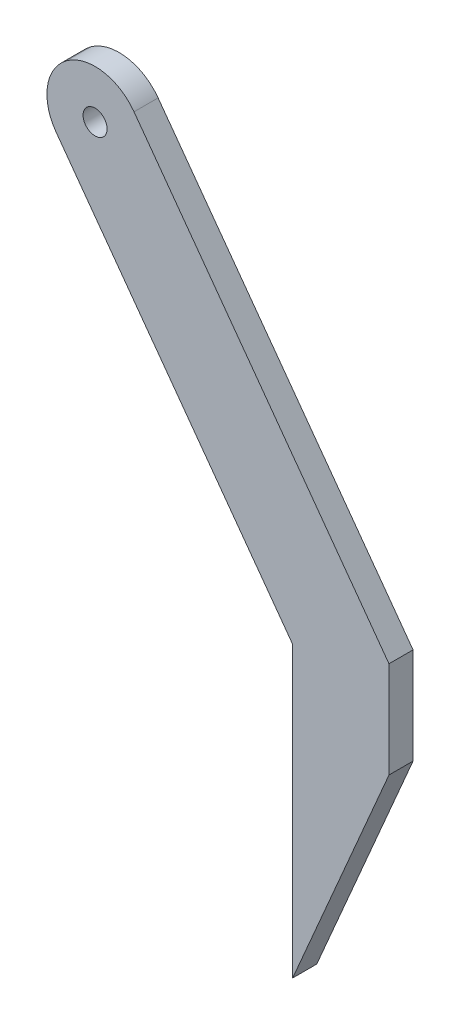
ISO-10303-21;
HEADER;
FILE_DESCRIPTION(('STEP AP214'),'2;1');
FILE_NAME('part.step','',(''),(''),'','','');
FILE_SCHEMA(('AUTOMOTIVE_DESIGN { 1 0 10303 214 1 1 1 1 }'));
ENDSEC;
DATA;
#1=APPLICATION_CONTEXT('core data for automotive mechanical design processes');
#2=APPLICATION_PROTOCOL_DEFINITION('international standard','automotive_design',2000,#1);
#3=PRODUCT_CONTEXT('',#1,'mechanical');
#4=PRODUCT('Part','Part','',(#3));
#5=PRODUCT_RELATED_PRODUCT_CATEGORY('part','',(#4));
#6=PRODUCT_DEFINITION_FORMATION('','',#4);
#7=PRODUCT_DEFINITION_CONTEXT('part definition',#1,'design');
#8=PRODUCT_DEFINITION('design','',#6,#7);
#9=PRODUCT_DEFINITION_SHAPE('','',#8);
#10=(LENGTH_UNIT() NAMED_UNIT(*) SI_UNIT(.MILLI.,.METRE.));
#11=(NAMED_UNIT(*) PLANE_ANGLE_UNIT() SI_UNIT($,.RADIAN.));
#12=(NAMED_UNIT(*) SI_UNIT($,.STERADIAN.) SOLID_ANGLE_UNIT());
#13=UNCERTAINTY_MEASURE_WITH_UNIT(LENGTH_MEASURE(1.E-05),#10,'distance_accuracy_value','');
#14=(GEOMETRIC_REPRESENTATION_CONTEXT(3) GLOBAL_UNCERTAINTY_ASSIGNED_CONTEXT((#13)) GLOBAL_UNIT_ASSIGNED_CONTEXT((#10,
#11,#12)) REPRESENTATION_CONTEXT('',''));
#15=CARTESIAN_POINT('',(0.,0.,0.));
#16=DIRECTION('',(0.,0.,1.));
#17=DIRECTION('',(1.,0.,0.));
#18=AXIS2_PLACEMENT_3D('',#15,#16,#17);
#19=CARTESIAN_POINT('',(26.3484260996102,-41.8429906454596,12.7));
#20=DIRECTION('',(0.808736084303188,0.588171697675046,0.));
#21=DIRECTION('',(-0.588171697675047,0.808736084303189,0.));
#22=AXIS2_PLACEMENT_3D('',#19,#20,#21);
#23=PLANE('',#22);
#24=DIRECTION('',(0.588171697675046,-0.808736084303188,0.));
#25=VECTOR('',#24,1.);
#26=CARTESIAN_POINT('',(26.3484260996102,-41.8429906454596,12.7));
#27=LINE('',#26,#25);
#28=CARTESIAN_POINT('',(-98.3914170715074,129.674293714827,12.7));
#29=VERTEX_POINT('',#28);
#30=CARTESIAN_POINT('',(26.3484260996102,-41.8429906454596,12.7));
#31=VERTEX_POINT('',#30);
#32=EDGE_CURVE('E88',#29,#31,#27,.T.);
#33=ORIENTED_EDGE('',*,*,#32,.F.);
#34=DIRECTION('',(0.,0.,-1.));
#35=VECTOR('',#34,1.);
#36=CARTESIAN_POINT('',(-98.3914170715074,129.674293714827,12.7));
#37=LINE('',#36,#35);
#38=CARTESIAN_POINT('',(-98.3914170715074,129.674293714827,0.));
#39=VERTEX_POINT('',#38);
#40=EDGE_CURVE('E112',#29,#39,#37,.T.);
#41=ORIENTED_EDGE('',*,*,#40,.T.);
#42=DIRECTION('',(0.588171697675046,-0.808736084303188,0.));
#43=VECTOR('',#42,1.);
#44=CARTESIAN_POINT('',(26.3484260996102,-41.8429906454596,0.));
#45=LINE('',#44,#43);
#46=CARTESIAN_POINT('',(26.3484260996102,-41.8429906454596,0.));
#47=VERTEX_POINT('',#46);
#48=EDGE_CURVE('E110',#39,#47,#45,.T.);
#49=ORIENTED_EDGE('',*,*,#48,.T.);
#50=DIRECTION('',(0.,0.,-1.));
#51=VECTOR('',#50,1.);
#52=CARTESIAN_POINT('',(26.3484260996102,-41.8429906454596,12.7));
#53=LINE('',#52,#51);
#54=EDGE_CURVE('E103',#31,#47,#53,.T.);
#55=ORIENTED_EDGE('',*,*,#54,.F.);
#56=EDGE_LOOP('',(#33,#41,#49,#55));
#57=FACE_BOUND('',#56,.T.);
#58=ADVANCED_FACE('F30',(#57),#23,.F.);
#59=CARTESIAN_POINT('',(26.3484260996102,-194.24299064546,12.7));
#60=DIRECTION('',(1.,0.,0.));
#61=DIRECTION('',(0.,1.,0.));
#62=AXIS2_PLACEMENT_3D('',#59,#60,#61);
#63=PLANE('',#62);
#64=DIRECTION('',(0.,-1.,0.));
#65=VECTOR('',#64,1.);
#66=CARTESIAN_POINT('',(26.3484260996102,-194.24299064546,0.));
#67=LINE('',#66,#65);
#68=CARTESIAN_POINT('',(26.3484260996102,-194.24299064546,0.));
#69=VERTEX_POINT('',#68);
#70=EDGE_CURVE('E133',#47,#69,#67,.T.);
#71=ORIENTED_EDGE('',*,*,#70,.T.);
#72=DIRECTION('',(0.,0.,-1.));
#73=VECTOR('',#72,1.);
#74=CARTESIAN_POINT('',(26.3484260996102,-194.24299064546,12.7));
#75=LINE('',#74,#73);
#76=CARTESIAN_POINT('',(26.3484260996102,-194.24299064546,12.7));
#77=VERTEX_POINT('',#76);
#78=EDGE_CURVE('E105',#77,#69,#75,.T.);
#79=ORIENTED_EDGE('',*,*,#78,.F.);
#80=DIRECTION('',(0.,-1.,0.));
#81=VECTOR('',#80,1.);
#82=CARTESIAN_POINT('',(26.3484260996102,-194.24299064546,12.7));
#83=LINE('',#82,#81);
#84=EDGE_CURVE('E91',#31,#77,#83,.T.);
#85=ORIENTED_EDGE('',*,*,#84,.F.);
#86=ORIENTED_EDGE('',*,*,#54,.T.);
#87=EDGE_LOOP('',(#71,#79,#85,#86));
#88=FACE_BOUND('',#87,.T.);
#89=ADVANCED_FACE('F102',(#88),#63,.F.);
#90=CARTESIAN_POINT('',(77.1484260996102,-76.1236529149896,12.7));
#91=DIRECTION('',(-0.91864467419625,0.395084753655296,0.));
#92=DIRECTION('',(-0.395084753655296,-0.91864467419625,0.));
#93=AXIS2_PLACEMENT_3D('',#90,#91,#92);
#94=PLANE('',#93);
#95=DIRECTION('',(0.395084753655296,0.91864467419625,0.));
#96=VECTOR('',#95,1.);
#97=CARTESIAN_POINT('',(77.1484260996102,-76.1236529149896,0.));
#98=LINE('',#97,#96);
#99=CARTESIAN_POINT('',(77.1484260996102,-76.1236529149896,0.));
#100=VERTEX_POINT('',#99);
#101=EDGE_CURVE('E150',#69,#100,#98,.T.);
#102=ORIENTED_EDGE('',*,*,#101,.T.);
#103=DIRECTION('',(0.,0.,-1.));
#104=VECTOR('',#103,1.);
#105=CARTESIAN_POINT('',(77.1484260996102,-76.1236529149896,12.7));
#106=LINE('',#105,#104);
#107=CARTESIAN_POINT('',(77.1484260996102,-76.1236529149896,12.7));
#108=VERTEX_POINT('',#107);
#109=EDGE_CURVE('E116',#108,#100,#106,.T.);
#110=ORIENTED_EDGE('',*,*,#109,.F.);
#111=DIRECTION('',(0.395084753655296,0.91864467419625,0.));
#112=VECTOR('',#111,1.);
#113=CARTESIAN_POINT('',(77.1484260996102,-76.1236529149896,12.7));
#114=LINE('',#113,#112);
#115=EDGE_CURVE('E107',#77,#108,#114,.T.);
#116=ORIENTED_EDGE('',*,*,#115,.F.);
#117=ORIENTED_EDGE('',*,*,#78,.T.);
#118=EDGE_LOOP('',(#102,#110,#116,#117));
#119=FACE_BOUND('',#118,.T.);
#120=ADVANCED_FACE('F166',(#119),#94,.F.);
#121=CARTESIAN_POINT('',(77.1484260996102,-25.3236529149896,12.7));
#122=DIRECTION('',(-1.,0.,0.));
#123=DIRECTION('',(0.,-1.,0.));
#124=AXIS2_PLACEMENT_3D('',#121,#122,#123);
#125=PLANE('',#124);
#126=DIRECTION('',(0.,1.,0.));
#127=VECTOR('',#126,1.);
#128=CARTESIAN_POINT('',(77.1484260996102,-25.3236529149896,0.));
#129=LINE('',#128,#127);
#130=CARTESIAN_POINT('',(77.1484260996102,-25.3236529149896,0.));
#131=VERTEX_POINT('',#130);
#132=EDGE_CURVE('E152',#100,#131,#129,.T.);
#133=ORIENTED_EDGE('',*,*,#132,.T.);
#134=DIRECTION('',(0.,0.,-1.));
#135=VECTOR('',#134,1.);
#136=CARTESIAN_POINT('',(77.1484260996102,-25.3236529149896,12.7));
#137=LINE('',#136,#135);
#138=CARTESIAN_POINT('',(77.1484260996102,-25.3236529149896,12.7));
#139=VERTEX_POINT('',#138);
#140=EDGE_CURVE('E147',#139,#131,#137,.T.);
#141=ORIENTED_EDGE('',*,*,#140,.F.);
#142=DIRECTION('',(0.,1.,0.));
#143=VECTOR('',#142,1.);
#144=CARTESIAN_POINT('',(77.1484260996102,-25.3236529149896,12.7));
#145=LINE('',#144,#143);
#146=EDGE_CURVE('E144',#108,#139,#145,.T.);
#147=ORIENTED_EDGE('',*,*,#146,.F.);
#148=ORIENTED_EDGE('',*,*,#109,.T.);
#149=EDGE_LOOP('',(#133,#141,#147,#148));
#150=FACE_BOUND('',#149,.T.);
#151=ADVANCED_FACE('F161',(#150),#125,.F.);
#152=CARTESIAN_POINT('',(-72.2471851098516,180.09531249802,12.7));
#153=DIRECTION('',(-0.808736084303188,-0.588171697675047,0.));
#154=DIRECTION('',(0.588171697675047,-0.808736084303188,0.));
#155=AXIS2_PLACEMENT_3D('',#152,#153,#154);
#156=PLANE('',#155);
#157=DIRECTION('',(-0.588171697675046,0.808736084303188,0.));
#158=VECTOR('',#157,1.);
#159=CARTESIAN_POINT('',(-72.2471851098516,180.09531249802,0.));
#160=LINE('',#159,#158);
#161=CARTESIAN_POINT('',(-57.3076239889054,159.553415956719,0.));
#162=VERTEX_POINT('',#161);
#163=EDGE_CURVE('E98',#131,#162,#160,.T.);
#164=ORIENTED_EDGE('',*,*,#163,.T.);
#165=DIRECTION('',(0.,0.,-1.));
#166=VECTOR('',#165,1.);
#167=CARTESIAN_POINT('',(-57.3076239889054,159.553415956719,12.7));
#168=LINE('',#167,#166);
#169=CARTESIAN_POINT('',(-57.3076239889054,159.553415956719,12.7));
#170=VERTEX_POINT('',#169);
#171=EDGE_CURVE('E11',#162,#170,#168,.F.);
#172=ORIENTED_EDGE('',*,*,#171,.T.);
#173=DIRECTION('',(-0.588171697675046,0.808736084303188,0.));
#174=VECTOR('',#173,1.);
#175=CARTESIAN_POINT('',(-72.2471851098516,180.09531249802,12.7));
#176=LINE('',#175,#174);
#177=EDGE_CURVE('E146',#139,#170,#176,.T.);
#178=ORIENTED_EDGE('',*,*,#177,.F.);
#179=ORIENTED_EDGE('',*,*,#140,.T.);
#180=EDGE_LOOP('',(#164,#172,#178,#179));
#181=FACE_BOUND('',#180,.T.);
#182=ADVANCED_FACE('F165',(#181),#156,.F.);
#183=CARTESIAN_POINT('',(-113.330978192454,150.216190256128,12.7));
#184=DIRECTION('',(0.,0.,-1.));
#185=DIRECTION('',(-1.,0.,0.));
#186=AXIS2_PLACEMENT_3D('',#183,#184,#185);
#187=PLANE('',#186);
#188=CARTESIAN_POINT('',(-77.8495205302064,144.613854835773,12.7));
#189=DIRECTION('',(0.,0.,-1.));
#190=DIRECTION('',(-1.,0.,0.));
#191=AXIS2_PLACEMENT_3D('',#188,#189,#190);
#192=CIRCLE('',#191,6.34999999999999);
#193=CARTESIAN_POINT('',(-84.1995205302064,144.613854835773,12.7));
#194=VERTEX_POINT('',#193);
#195=EDGE_CURVE('E132',#194,#194,#192,.T.);
#196=ORIENTED_EDGE('',*,*,#195,.T.);
#197=EDGE_LOOP('',(#196));
#198=FACE_BOUND('',#197,.T.);
#199=CARTESIAN_POINT('',(-77.8495205302064,144.613854835773,12.7));
#200=DIRECTION('',(0.,0.,-1.));
#201=DIRECTION('',(-1.,0.,0.));
#202=AXIS2_PLACEMENT_3D('',#199,#200,#201);
#203=CIRCLE('',#202,25.4);
#204=CARTESIAN_POINT('',(-92.7890816511526,165.155751377074,12.7));
#205=VERTEX_POINT('',#204);
#206=EDGE_CURVE('E46',#170,#205,#203,.F.);
#207=ORIENTED_EDGE('',*,*,#206,.T.);
#208=CARTESIAN_POINT('',(-77.8495205302064,144.613854835773,12.7));
#209=DIRECTION('',(0.,0.,-1.));
#210=DIRECTION('',(-1.,0.,0.));
#211=AXIS2_PLACEMENT_3D('',#208,#209,#210);
#212=CIRCLE('',#211,25.4);
#213=EDGE_CURVE('E39',#205,#29,#212,.F.);
#214=ORIENTED_EDGE('',*,*,#213,.T.);
#215=ORIENTED_EDGE('',*,*,#32,.T.);
#216=ORIENTED_EDGE('',*,*,#84,.T.);
#217=ORIENTED_EDGE('',*,*,#115,.T.);
#218=ORIENTED_EDGE('',*,*,#146,.T.);
#219=ORIENTED_EDGE('',*,*,#177,.T.);
#220=EDGE_LOOP('',(#207,#214,#215,#216,#217,#218,#219));
#221=FACE_BOUND('',#220,.T.);
#222=ADVANCED_FACE('F90',(#198,#221),#187,.F.);
#223=CARTESIAN_POINT('',(-113.330978192454,150.216190256128,0.));
#224=DIRECTION('',(0.,0.,-1.));
#225=DIRECTION('',(-1.,0.,0.));
#226=AXIS2_PLACEMENT_3D('',#223,#224,#225);
#227=PLANE('',#226);
#228=CARTESIAN_POINT('',(-77.8495205302064,144.613854835773,0.));
#229=DIRECTION('',(0.,0.,-1.));
#230=DIRECTION('',(-1.,0.,0.));
#231=AXIS2_PLACEMENT_3D('',#228,#229,#230);
#232=CIRCLE('',#231,6.34999999999999);
#233=CARTESIAN_POINT('',(-84.1995205302064,144.613854835773,0.));
#234=VERTEX_POINT('',#233);
#235=EDGE_CURVE('E136',#234,#234,#232,.T.);
#236=ORIENTED_EDGE('',*,*,#235,.F.);
#237=EDGE_LOOP('',(#236));
#238=FACE_BOUND('',#237,.T.);
#239=ORIENTED_EDGE('',*,*,#48,.F.);
#240=CARTESIAN_POINT('',(-77.8495205302064,144.613854835773,0.));
#241=DIRECTION('',(0.,0.,-1.));
#242=DIRECTION('',(-1.,0.,0.));
#243=AXIS2_PLACEMENT_3D('',#240,#241,#242);
#244=CIRCLE('',#243,25.4);
#245=CARTESIAN_POINT('',(-92.7890816511526,165.155751377074,0.));
#246=VERTEX_POINT('',#245);
#247=EDGE_CURVE('E121',#39,#246,#244,.T.);
#248=ORIENTED_EDGE('',*,*,#247,.T.);
#249=CARTESIAN_POINT('',(-77.8495205302064,144.613854835773,0.));
#250=DIRECTION('',(0.,0.,-1.));
#251=DIRECTION('',(-1.,0.,0.));
#252=AXIS2_PLACEMENT_3D('',#249,#250,#251);
#253=CIRCLE('',#252,25.4);
#254=EDGE_CURVE('E114',#246,#162,#253,.T.);
#255=ORIENTED_EDGE('',*,*,#254,.T.);
#256=ORIENTED_EDGE('',*,*,#163,.F.);
#257=ORIENTED_EDGE('',*,*,#132,.F.);
#258=ORIENTED_EDGE('',*,*,#101,.F.);
#259=ORIENTED_EDGE('',*,*,#70,.F.);
#260=EDGE_LOOP('',(#239,#248,#255,#256,#257,#258,#259));
#261=FACE_BOUND('',#260,.T.);
#262=ADVANCED_FACE('F126',(#238,#261),#227,.T.);
#263=CARTESIAN_POINT('',(-77.8495205302064,144.613854835773,12.7));
#264=DIRECTION('',(0.,0.,-1.));
#265=DIRECTION('',(-1.,0.,0.));
#266=AXIS2_PLACEMENT_3D('',#263,#264,#265);
#267=CYLINDRICAL_SURFACE('',#266,25.4);
#268=DIRECTION('',(0.,0.,-1.));
#269=VECTOR('',#268,1.);
#270=CARTESIAN_POINT('',(-92.7890816511526,165.155751377074,12.7));
#271=LINE('',#270,#269);
#272=EDGE_CURVE('E34',#205,#246,#271,.T.);
#273=ORIENTED_EDGE('',*,*,#272,.F.);
#274=ORIENTED_EDGE('',*,*,#206,.F.);
#275=ORIENTED_EDGE('',*,*,#171,.F.);
#276=ORIENTED_EDGE('',*,*,#254,.F.);
#277=EDGE_LOOP('',(#273,#274,#275,#276));
#278=FACE_BOUND('',#277,.T.);
#279=ADVANCED_FACE('F32',(#278),#267,.T.);
#280=CARTESIAN_POINT('',(-77.8495205302064,144.613854835773,12.7));
#281=DIRECTION('',(0.,0.,-1.));
#282=DIRECTION('',(-1.,0.,0.));
#283=AXIS2_PLACEMENT_3D('',#280,#281,#282);
#284=CYLINDRICAL_SURFACE('',#283,25.4);
#285=ORIENTED_EDGE('',*,*,#213,.F.);
#286=ORIENTED_EDGE('',*,*,#272,.T.);
#287=ORIENTED_EDGE('',*,*,#247,.F.);
#288=ORIENTED_EDGE('',*,*,#40,.F.);
#289=EDGE_LOOP('',(#285,#286,#287,#288));
#290=FACE_BOUND('',#289,.T.);
#291=ADVANCED_FACE('F131',(#290),#284,.T.);
#292=CARTESIAN_POINT('',(-77.8495205302064,144.613854835773,0.));
#293=DIRECTION('',(0.,0.,-1.));
#294=DIRECTION('',(-1.,0.,0.));
#295=AXIS2_PLACEMENT_3D('',#292,#293,#294);
#296=CYLINDRICAL_SURFACE('',#295,6.34999999999999);
#297=ORIENTED_EDGE('',*,*,#235,.T.);
#298=EDGE_LOOP('',(#297));
#299=FACE_BOUND('',#298,.T.);
#300=ORIENTED_EDGE('',*,*,#195,.F.);
#301=EDGE_LOOP('',(#300));
#302=FACE_BOUND('',#301,.T.);
#303=ADVANCED_FACE('F180',(#299,#302),#296,.F.);
#304=CLOSED_SHELL('',(#58,#89,#120,#151,#182,#222,#262,#279,#291,#303));
#305=MANIFOLD_SOLID_BREP('B2',#304);
#306=ADVANCED_BREP_SHAPE_REPRESENTATION('',(#18,#305),#14);
#307=SHAPE_DEFINITION_REPRESENTATION(#9,#306);
ENDSEC;
END-ISO-10303-21;
